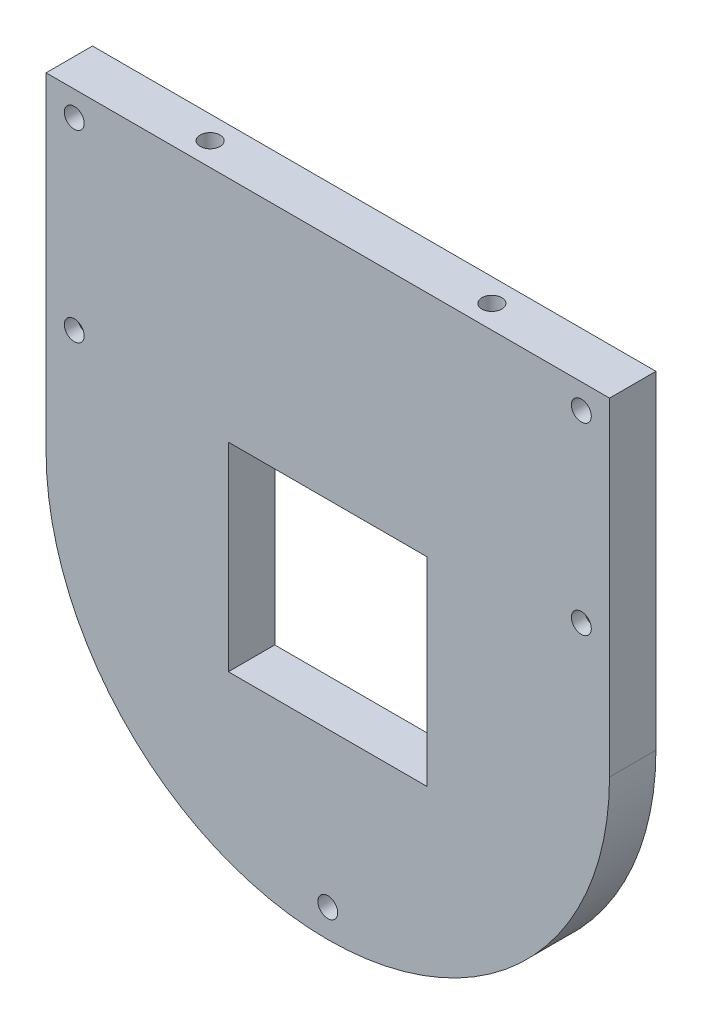
ISO-10303-21;
HEADER;
FILE_DESCRIPTION(('STEP AP214'),'2;1');
FILE_NAME('part.step','',(''),(''),'','','');
FILE_SCHEMA(('AUTOMOTIVE_DESIGN { 1 0 10303 214 1 1 1 1 }'));
ENDSEC;
DATA;
#1=APPLICATION_CONTEXT('core data for automotive mechanical design processes');
#2=APPLICATION_PROTOCOL_DEFINITION('international standard','automotive_design',2000,#1);
#3=PRODUCT_CONTEXT('',#1,'mechanical');
#4=PRODUCT('Part','Part','',(#3));
#5=PRODUCT_RELATED_PRODUCT_CATEGORY('part','',(#4));
#6=PRODUCT_DEFINITION_FORMATION('','',#4);
#7=PRODUCT_DEFINITION_CONTEXT('part definition',#1,'design');
#8=PRODUCT_DEFINITION('design','',#6,#7);
#9=PRODUCT_DEFINITION_SHAPE('','',#8);
#10=(LENGTH_UNIT() NAMED_UNIT(*) SI_UNIT(.MILLI.,.METRE.));
#11=(NAMED_UNIT(*) PLANE_ANGLE_UNIT() SI_UNIT($,.RADIAN.));
#12=(NAMED_UNIT(*) SI_UNIT($,.STERADIAN.) SOLID_ANGLE_UNIT());
#13=UNCERTAINTY_MEASURE_WITH_UNIT(LENGTH_MEASURE(1.E-05),#10,'distance_accuracy_value','');
#14=(GEOMETRIC_REPRESENTATION_CONTEXT(3) GLOBAL_UNCERTAINTY_ASSIGNED_CONTEXT((#13)) GLOBAL_UNIT_ASSIGNED_CONTEXT((#10,
#11,#12)) REPRESENTATION_CONTEXT('',''));
#15=CARTESIAN_POINT('',(0.,0.,0.));
#16=DIRECTION('',(0.,0.,1.));
#17=DIRECTION('',(1.,0.,0.));
#18=AXIS2_PLACEMENT_3D('',#15,#16,#17);
#19=CARTESIAN_POINT('',(80.75,63.,-3.));
#20=DIRECTION('',(0.,0.,1.));
#21=DIRECTION('',(1.,0.,0.));
#22=AXIS2_PLACEMENT_3D('',#19,#20,#21);
#23=CYLINDRICAL_SURFACE('',#22,1.5);
#24=CARTESIAN_POINT('',(80.75,63.,7.));
#25=DIRECTION('',(0.,0.,1.));
#26=DIRECTION('',(1.,0.,0.));
#27=AXIS2_PLACEMENT_3D('',#24,#25,#26);
#28=CIRCLE('',#27,1.5);
#29=CARTESIAN_POINT('',(82.25,63.,7.));
#30=VERTEX_POINT('',#29);
#31=EDGE_CURVE('E227',#30,#30,#28,.T.);
#32=ORIENTED_EDGE('',*,*,#31,.T.);
#33=EDGE_LOOP('',(#32));
#34=FACE_BOUND('',#33,.T.);
#35=CARTESIAN_POINT('',(80.75,63.,5.));
#36=DIRECTION('',(0.,0.,-1.));
#37=DIRECTION('',(-1.,0.,0.));
#38=AXIS2_PLACEMENT_3D('',#35,#36,#37);
#39=CIRCLE('',#38,1.5);
#40=CARTESIAN_POINT('',(79.25,63.,5.));
#41=VERTEX_POINT('',#40);
#42=EDGE_CURVE('E215',#41,#41,#39,.F.);
#43=ORIENTED_EDGE('',*,*,#42,.F.);
#44=EDGE_LOOP('',(#43));
#45=FACE_BOUND('',#44,.T.);
#46=ADVANCED_FACE('F42',(#34,#45),#23,.F.);
#47=CARTESIAN_POINT('',(85.,0.,7.));
#48=DIRECTION('',(-1.,0.,0.));
#49=DIRECTION('',(0.,0.,1.));
#50=AXIS2_PLACEMENT_3D('',#47,#48,#49);
#51=PLANE('',#50);
#52=DIRECTION('',(0.,1.,0.));
#53=VECTOR('',#52,1.);
#54=CARTESIAN_POINT('',(85.,0.,0.));
#55=LINE('',#54,#53);
#56=CARTESIAN_POINT('',(85.,45.,0.));
#57=VERTEX_POINT('',#56);
#58=CARTESIAN_POINT('',(85.,94.5,0.));
#59=VERTEX_POINT('',#58);
#60=EDGE_CURVE('E202',#57,#59,#55,.T.);
#61=ORIENTED_EDGE('',*,*,#60,.T.);
#62=DIRECTION('',(0.,0.,-1.));
#63=VECTOR('',#62,1.);
#64=CARTESIAN_POINT('',(85.,94.5,7.));
#65=LINE('',#64,#63);
#66=CARTESIAN_POINT('',(85.,94.5,7.));
#67=VERTEX_POINT('',#66);
#68=EDGE_CURVE('E60',#67,#59,#65,.T.);
#69=ORIENTED_EDGE('',*,*,#68,.F.);
#70=DIRECTION('',(0.,1.,0.));
#71=VECTOR('',#70,1.);
#72=CARTESIAN_POINT('',(85.,0.,7.));
#73=LINE('',#72,#71);
#74=CARTESIAN_POINT('',(85.,45.,7.));
#75=VERTEX_POINT('',#74);
#76=EDGE_CURVE('E11',#75,#67,#73,.T.);
#77=ORIENTED_EDGE('',*,*,#76,.F.);
#78=DIRECTION('',(0.,0.,-1.));
#79=VECTOR('',#78,1.);
#80=CARTESIAN_POINT('',(85.,45.,10.));
#81=LINE('',#80,#79);
#82=EDGE_CURVE('E239',#75,#57,#81,.T.);
#83=ORIENTED_EDGE('',*,*,#82,.T.);
#84=EDGE_LOOP('',(#61,#69,#77,#83));
#85=FACE_BOUND('',#84,.T.);
#86=ADVANCED_FACE('F343',(#85),#51,.F.);
#87=CARTESIAN_POINT('',(0.,0.,7.));
#88=DIRECTION('',(1.,0.,0.));
#89=DIRECTION('',(0.,0.,-1.));
#90=AXIS2_PLACEMENT_3D('',#87,#88,#89);
#91=PLANE('',#90);
#92=DIRECTION('',(0.,-1.,0.));
#93=VECTOR('',#92,1.);
#94=CARTESIAN_POINT('',(0.,0.,7.));
#95=LINE('',#94,#93);
#96=CARTESIAN_POINT('',(0.,94.5,7.));
#97=VERTEX_POINT('',#96);
#98=CARTESIAN_POINT('',(0.,45.,7.));
#99=VERTEX_POINT('',#98);
#100=EDGE_CURVE('E52',#97,#99,#95,.T.);
#101=ORIENTED_EDGE('',*,*,#100,.F.);
#102=DIRECTION('',(0.,0.,1.));
#103=VECTOR('',#102,1.);
#104=CARTESIAN_POINT('',(0.,94.5,7.));
#105=LINE('',#104,#103);
#106=CARTESIAN_POINT('',(0.,94.5,0.));
#107=VERTEX_POINT('',#106);
#108=EDGE_CURVE('E180',#107,#97,#105,.T.);
#109=ORIENTED_EDGE('',*,*,#108,.F.);
#110=DIRECTION('',(0.,-1.,0.));
#111=VECTOR('',#110,1.);
#112=CARTESIAN_POINT('',(0.,0.,0.));
#113=LINE('',#112,#111);
#114=CARTESIAN_POINT('',(0.,45.,0.));
#115=VERTEX_POINT('',#114);
#116=EDGE_CURVE('E206',#107,#115,#113,.T.);
#117=ORIENTED_EDGE('',*,*,#116,.T.);
#118=DIRECTION('',(0.,0.,-1.));
#119=VECTOR('',#118,1.);
#120=CARTESIAN_POINT('',(0.,45.,10.));
#121=LINE('',#120,#119);
#122=EDGE_CURVE('E200',#99,#115,#121,.T.);
#123=ORIENTED_EDGE('',*,*,#122,.F.);
#124=EDGE_LOOP('',(#101,#109,#117,#123));
#125=FACE_BOUND('',#124,.T.);
#126=ADVANCED_FACE('F44',(#125),#91,.F.);
#127=CARTESIAN_POINT('',(0.,0.,7.));
#128=DIRECTION('',(0.,0.,-1.));
#129=DIRECTION('',(-1.,0.,0.));
#130=AXIS2_PLACEMENT_3D('',#127,#128,#129);
#131=PLANE('',#130);
#132=CARTESIAN_POINT('',(42.5,6.75,7.));
#133=DIRECTION('',(0.,0.,1.));
#134=DIRECTION('',(1.,0.,0.));
#135=AXIS2_PLACEMENT_3D('',#132,#133,#134);
#136=CIRCLE('',#135,1.5);
#137=CARTESIAN_POINT('',(44.,6.75,7.));
#138=VERTEX_POINT('',#137);
#139=EDGE_CURVE('E717',#138,#138,#136,.T.);
#140=ORIENTED_EDGE('',*,*,#139,.F.);
#141=EDGE_LOOP('',(#140));
#142=FACE_BOUND('',#141,.T.);
#143=ORIENTED_EDGE('',*,*,#31,.F.);
#144=EDGE_LOOP('',(#143));
#145=FACE_BOUND('',#144,.T.);
#146=CARTESIAN_POINT('',(4.24999999999999,63.,7.));
#147=DIRECTION('',(0.,0.,1.));
#148=DIRECTION('',(-1.,0.,0.));
#149=AXIS2_PLACEMENT_3D('',#146,#147,#148);
#150=CIRCLE('',#149,1.5);
#151=CARTESIAN_POINT('',(2.74999999999999,63.,7.));
#152=VERTEX_POINT('',#151);
#153=EDGE_CURVE('E222',#152,#152,#150,.T.);
#154=ORIENTED_EDGE('',*,*,#153,.F.);
#155=EDGE_LOOP('',(#154));
#156=FACE_BOUND('',#155,.T.);
#157=CARTESIAN_POINT('',(4.24999999999999,90.75,7.));
#158=DIRECTION('',(0.,0.,-1.));
#159=DIRECTION('',(-1.,0.,0.));
#160=AXIS2_PLACEMENT_3D('',#157,#158,#159);
#161=CIRCLE('',#160,1.5);
#162=CARTESIAN_POINT('',(2.74999999999999,90.75,7.));
#163=VERTEX_POINT('',#162);
#164=EDGE_CURVE('E260',#163,#163,#161,.T.);
#165=ORIENTED_EDGE('',*,*,#164,.T.);
#166=EDGE_LOOP('',(#165));
#167=FACE_BOUND('',#166,.T.);
#168=CARTESIAN_POINT('',(80.75,90.75,7.));
#169=DIRECTION('',(0.,0.,-1.));
#170=DIRECTION('',(-1.,0.,0.));
#171=AXIS2_PLACEMENT_3D('',#168,#169,#170);
#172=CIRCLE('',#171,1.5);
#173=CARTESIAN_POINT('',(79.25,90.75,7.));
#174=VERTEX_POINT('',#173);
#175=EDGE_CURVE('E256',#174,#174,#172,.T.);
#176=ORIENTED_EDGE('',*,*,#175,.T.);
#177=EDGE_LOOP('',(#176));
#178=FACE_BOUND('',#177,.T.);
#179=DIRECTION('',(-1.,0.,0.));
#180=VECTOR('',#179,1.);
#181=CARTESIAN_POINT('',(27.5,60.,7.));
#182=LINE('',#181,#180);
#183=CARTESIAN_POINT('',(57.5,60.,7.));
#184=VERTEX_POINT('',#183);
#185=CARTESIAN_POINT('',(27.5,60.,7.));
#186=VERTEX_POINT('',#185);
#187=EDGE_CURVE('E292',#184,#186,#182,.T.);
#188=ORIENTED_EDGE('',*,*,#187,.F.);
#189=DIRECTION('',(0.,1.,0.));
#190=VECTOR('',#189,1.);
#191=CARTESIAN_POINT('',(57.5,30.,7.));
#192=LINE('',#191,#190);
#193=CARTESIAN_POINT('',(57.5,30.,7.));
#194=VERTEX_POINT('',#193);
#195=EDGE_CURVE('E269',#194,#184,#192,.T.);
#196=ORIENTED_EDGE('',*,*,#195,.F.);
#197=DIRECTION('',(1.,0.,0.));
#198=VECTOR('',#197,1.);
#199=CARTESIAN_POINT('',(27.5,30.,7.));
#200=LINE('',#199,#198);
#201=CARTESIAN_POINT('',(27.5,30.,7.));
#202=VERTEX_POINT('',#201);
#203=EDGE_CURVE('E278',#202,#194,#200,.T.);
#204=ORIENTED_EDGE('',*,*,#203,.F.);
#205=DIRECTION('',(0.,-1.,0.));
#206=VECTOR('',#205,1.);
#207=CARTESIAN_POINT('',(27.5,30.,7.));
#208=LINE('',#207,#206);
#209=EDGE_CURVE('E296',#186,#202,#208,.T.);
#210=ORIENTED_EDGE('',*,*,#209,.F.);
#211=EDGE_LOOP('',(#188,#196,#204,#210));
#212=FACE_BOUND('',#211,.T.);
#213=ORIENTED_EDGE('',*,*,#76,.T.);
#214=DIRECTION('',(1.,0.,0.));
#215=VECTOR('',#214,1.);
#216=CARTESIAN_POINT('',(0.,94.5,7.));
#217=LINE('',#216,#215);
#218=EDGE_CURVE('E184',#97,#67,#217,.T.);
#219=ORIENTED_EDGE('',*,*,#218,.F.);
#220=ORIENTED_EDGE('',*,*,#100,.T.);
#221=CARTESIAN_POINT('',(42.5,45.,7.));
#222=DIRECTION('',(0.,0.,-1.));
#223=DIRECTION('',(-1.,0.,0.));
#224=AXIS2_PLACEMENT_3D('',#221,#222,#223);
#225=CIRCLE('',#224,42.5);
#226=EDGE_CURVE('E242',#99,#75,#225,.F.);
#227=ORIENTED_EDGE('',*,*,#226,.T.);
#228=EDGE_LOOP('',(#213,#219,#220,#227));
#229=FACE_BOUND('',#228,.T.);
#230=ADVANCED_FACE('F192',(#142,#145,#156,#167,#178,#212,#229),#131,.F.);
#231=CARTESIAN_POINT('',(0.,0.,0.));
#232=DIRECTION('',(0.,0.,-1.));
#233=DIRECTION('',(-1.,0.,0.));
#234=AXIS2_PLACEMENT_3D('',#231,#232,#233);
#235=PLANE('',#234);
#236=DIRECTION('',(-1.,0.,0.));
#237=VECTOR('',#236,1.);
#238=CARTESIAN_POINT('',(0.,94.5,0.));
#239=LINE('',#238,#237);
#240=EDGE_CURVE('E185',#59,#107,#239,.T.);
#241=ORIENTED_EDGE('',*,*,#240,.F.);
#242=ORIENTED_EDGE('',*,*,#60,.F.);
#243=CARTESIAN_POINT('',(42.5,45.,0.));
#244=DIRECTION('',(0.,0.,1.));
#245=DIRECTION('',(-1.,0.,0.));
#246=AXIS2_PLACEMENT_3D('',#243,#244,#245);
#247=CIRCLE('',#246,42.5);
#248=EDGE_CURVE('E233',#115,#57,#247,.T.);
#249=ORIENTED_EDGE('',*,*,#248,.F.);
#250=ORIENTED_EDGE('',*,*,#116,.F.);
#251=EDGE_LOOP('',(#241,#242,#249,#250));
#252=FACE_BOUND('',#251,.T.);
#253=DIRECTION('',(0.5,0.866025403784438,0.));
#254=VECTOR('',#253,1.);
#255=CARTESIAN_POINT('',(77.34,63.,0.));
#256=LINE('',#255,#254);
#257=CARTESIAN_POINT('',(77.34,63.,0.));
#258=VERTEX_POINT('',#257);
#259=CARTESIAN_POINT('',(79.045,65.9531466269049,0.));
#260=VERTEX_POINT('',#259);
#261=EDGE_CURVE('E68',#258,#260,#256,.T.);
#262=ORIENTED_EDGE('',*,*,#261,.F.);
#263=DIRECTION('',(-0.499999999999997,0.86602540378444,0.));
#264=VECTOR('',#263,1.);
#265=CARTESIAN_POINT('',(79.045,60.0468533730951,0.));
#266=LINE('',#265,#264);
#267=CARTESIAN_POINT('',(79.045,60.0468533730951,0.));
#268=VERTEX_POINT('',#267);
#269=EDGE_CURVE('E744',#268,#258,#266,.T.);
#270=ORIENTED_EDGE('',*,*,#269,.F.);
#271=DIRECTION('',(-1.,0.,0.));
#272=VECTOR('',#271,1.);
#273=CARTESIAN_POINT('',(82.455,60.0468533730951,0.));
#274=LINE('',#273,#272);
#275=CARTESIAN_POINT('',(82.455,60.0468533730951,0.));
#276=VERTEX_POINT('',#275);
#277=EDGE_CURVE('E780',#276,#268,#274,.T.);
#278=ORIENTED_EDGE('',*,*,#277,.F.);
#279=DIRECTION('',(-0.500000000000003,-0.866025403784437,0.));
#280=VECTOR('',#279,1.);
#281=CARTESIAN_POINT('',(84.16,63.,0.));
#282=LINE('',#281,#280);
#283=CARTESIAN_POINT('',(84.16,63.,0.));
#284=VERTEX_POINT('',#283);
#285=EDGE_CURVE('E776',#284,#276,#282,.T.);
#286=ORIENTED_EDGE('',*,*,#285,.F.);
#287=DIRECTION('',(0.500000000000004,-0.866025403784436,0.));
#288=VECTOR('',#287,1.);
#289=CARTESIAN_POINT('',(82.455,65.9531466269049,0.));
#290=LINE('',#289,#288);
#291=CARTESIAN_POINT('',(82.455,65.9531466269049,0.));
#292=VERTEX_POINT('',#291);
#293=EDGE_CURVE('E772',#292,#284,#290,.T.);
#294=ORIENTED_EDGE('',*,*,#293,.F.);
#295=DIRECTION('',(1.,0.,0.));
#296=VECTOR('',#295,1.);
#297=CARTESIAN_POINT('',(79.045,65.9531466269049,0.));
#298=LINE('',#297,#296);
#299=EDGE_CURVE('E767',#260,#292,#298,.T.);
#300=ORIENTED_EDGE('',*,*,#299,.F.);
#301=EDGE_LOOP('',(#262,#270,#278,#286,#294,#300));
#302=FACE_BOUND('',#301,.T.);
#303=DIRECTION('',(0.500000000000004,0.866025403784436,0.));
#304=VECTOR('',#303,1.);
#305=CARTESIAN_POINT('',(2.54500000000001,65.9531466269049,0.));
#306=LINE('',#305,#304);
#307=CARTESIAN_POINT('',(0.840000000000021,63.,0.));
#308=VERTEX_POINT('',#307);
#309=CARTESIAN_POINT('',(2.54500000000001,65.9531466269049,0.));
#310=VERTEX_POINT('',#309);
#311=EDGE_CURVE('E768',#308,#310,#306,.T.);
#312=ORIENTED_EDGE('',*,*,#311,.F.);
#313=DIRECTION('',(-0.500000000000003,0.866025403784437,0.));
#314=VECTOR('',#313,1.);
#315=CARTESIAN_POINT('',(0.840000000000021,63.,0.));
#316=LINE('',#315,#314);
#317=CARTESIAN_POINT('',(2.54500000000003,60.0468533730951,0.));
#318=VERTEX_POINT('',#317);
#319=EDGE_CURVE('E822',#318,#308,#316,.T.);
#320=ORIENTED_EDGE('',*,*,#319,.F.);
#321=DIRECTION('',(-1.,0.,0.));
#322=VECTOR('',#321,1.);
#323=CARTESIAN_POINT('',(2.54500000000003,60.0468533730951,0.));
#324=LINE('',#323,#322);
#325=CARTESIAN_POINT('',(5.95499999999999,60.0468533730951,0.));
#326=VERTEX_POINT('',#325);
#327=EDGE_CURVE('E826',#326,#318,#324,.T.);
#328=ORIENTED_EDGE('',*,*,#327,.F.);
#329=DIRECTION('',(-0.499999999999997,-0.86602540378444,0.));
#330=VECTOR('',#329,1.);
#331=CARTESIAN_POINT('',(5.95499999999999,60.0468533730951,0.));
#332=LINE('',#331,#330);
#333=CARTESIAN_POINT('',(7.65999999999996,63.,0.));
#334=VERTEX_POINT('',#333);
#335=EDGE_CURVE('E831',#334,#326,#332,.T.);
#336=ORIENTED_EDGE('',*,*,#335,.F.);
#337=DIRECTION('',(0.5,-0.866025403784438,0.));
#338=VECTOR('',#337,1.);
#339=CARTESIAN_POINT('',(7.65999999999996,63.,0.));
#340=LINE('',#339,#338);
#341=CARTESIAN_POINT('',(5.95499999999997,65.9531466269049,0.));
#342=VERTEX_POINT('',#341);
#343=EDGE_CURVE('E835',#342,#334,#340,.T.);
#344=ORIENTED_EDGE('',*,*,#343,.F.);
#345=DIRECTION('',(1.,0.,0.));
#346=VECTOR('',#345,1.);
#347=CARTESIAN_POINT('',(5.95499999999997,65.9531466269049,0.));
#348=LINE('',#347,#346);
#349=EDGE_CURVE('E839',#310,#342,#348,.T.);
#350=ORIENTED_EDGE('',*,*,#349,.F.);
#351=EDGE_LOOP('',(#312,#320,#328,#336,#344,#350));
#352=FACE_BOUND('',#351,.T.);
#353=CARTESIAN_POINT('',(4.24999999999999,90.75,0.));
#354=DIRECTION('',(0.,0.,-1.));
#355=DIRECTION('',(1.,0.,0.));
#356=AXIS2_PLACEMENT_3D('',#353,#354,#355);
#357=CIRCLE('',#356,1.5);
#358=CARTESIAN_POINT('',(5.74999999999999,90.75,0.));
#359=VERTEX_POINT('',#358);
#360=EDGE_CURVE('E248',#359,#359,#357,.T.);
#361=ORIENTED_EDGE('',*,*,#360,.F.);
#362=EDGE_LOOP('',(#361));
#363=FACE_BOUND('',#362,.T.);
#364=CARTESIAN_POINT('',(80.75,90.75,0.));
#365=DIRECTION('',(0.,0.,-1.));
#366=DIRECTION('',(-1.,0.,0.));
#367=AXIS2_PLACEMENT_3D('',#364,#365,#366);
#368=CIRCLE('',#367,1.5);
#369=CARTESIAN_POINT('',(79.25,90.75,0.));
#370=VERTEX_POINT('',#369);
#371=EDGE_CURVE('E252',#370,#370,#368,.T.);
#372=ORIENTED_EDGE('',*,*,#371,.F.);
#373=EDGE_LOOP('',(#372));
#374=FACE_BOUND('',#373,.T.);
#375=DIRECTION('',(0.,1.,0.));
#376=VECTOR('',#375,1.);
#377=CARTESIAN_POINT('',(57.5,30.,0.));
#378=LINE('',#377,#376);
#379=CARTESIAN_POINT('',(57.5,30.,0.));
#380=VERTEX_POINT('',#379);
#381=CARTESIAN_POINT('',(57.5,60.,0.));
#382=VERTEX_POINT('',#381);
#383=EDGE_CURVE('E273',#380,#382,#378,.T.);
#384=ORIENTED_EDGE('',*,*,#383,.T.);
#385=DIRECTION('',(-1.,0.,0.));
#386=VECTOR('',#385,1.);
#387=CARTESIAN_POINT('',(27.5,60.,0.));
#388=LINE('',#387,#386);
#389=CARTESIAN_POINT('',(27.5,60.,0.));
#390=VERTEX_POINT('',#389);
#391=EDGE_CURVE('E277',#382,#390,#388,.T.);
#392=ORIENTED_EDGE('',*,*,#391,.T.);
#393=DIRECTION('',(0.,-1.,0.));
#394=VECTOR('',#393,1.);
#395=CARTESIAN_POINT('',(27.5,30.,0.));
#396=LINE('',#395,#394);
#397=CARTESIAN_POINT('',(27.5,30.,0.));
#398=VERTEX_POINT('',#397);
#399=EDGE_CURVE('E282',#390,#398,#396,.T.);
#400=ORIENTED_EDGE('',*,*,#399,.T.);
#401=DIRECTION('',(1.,0.,0.));
#402=VECTOR('',#401,1.);
#403=CARTESIAN_POINT('',(27.5,30.,0.));
#404=LINE('',#403,#402);
#405=EDGE_CURVE('E286',#398,#380,#404,.T.);
#406=ORIENTED_EDGE('',*,*,#405,.T.);
#407=EDGE_LOOP('',(#384,#392,#400,#406));
#408=FACE_BOUND('',#407,.T.);
#409=ADVANCED_FACE('F328',(#252,#302,#352,#363,#374,#408),#235,.T.);
#410=CARTESIAN_POINT('',(57.5,30.,0.));
#411=DIRECTION('',(1.,0.,0.));
#412=DIRECTION('',(0.,0.,-1.));
#413=AXIS2_PLACEMENT_3D('',#410,#411,#412);
#414=PLANE('',#413);
#415=ORIENTED_EDGE('',*,*,#195,.T.);
#416=DIRECTION('',(0.,0.,1.));
#417=VECTOR('',#416,1.);
#418=CARTESIAN_POINT('',(57.5,60.,0.));
#419=LINE('',#418,#417);
#420=EDGE_CURVE('E209',#382,#184,#419,.T.);
#421=ORIENTED_EDGE('',*,*,#420,.F.);
#422=ORIENTED_EDGE('',*,*,#383,.F.);
#423=DIRECTION('',(0.,0.,1.));
#424=VECTOR('',#423,1.);
#425=CARTESIAN_POINT('',(57.5,30.,0.));
#426=LINE('',#425,#424);
#427=EDGE_CURVE('E213',#380,#194,#426,.T.);
#428=ORIENTED_EDGE('',*,*,#427,.T.);
#429=EDGE_LOOP('',(#415,#421,#422,#428));
#430=FACE_BOUND('',#429,.T.);
#431=ADVANCED_FACE('F329',(#430),#414,.F.);
#432=CARTESIAN_POINT('',(27.5,30.,0.));
#433=DIRECTION('',(0.,-1.,0.));
#434=DIRECTION('',(0.,0.,-1.));
#435=AXIS2_PLACEMENT_3D('',#432,#433,#434);
#436=PLANE('',#435);
#437=ORIENTED_EDGE('',*,*,#203,.T.);
#438=ORIENTED_EDGE('',*,*,#427,.F.);
#439=ORIENTED_EDGE('',*,*,#405,.F.);
#440=DIRECTION('',(0.,0.,1.));
#441=VECTOR('',#440,1.);
#442=CARTESIAN_POINT('',(27.5,30.,0.));
#443=LINE('',#442,#441);
#444=EDGE_CURVE('E305',#398,#202,#443,.T.);
#445=ORIENTED_EDGE('',*,*,#444,.T.);
#446=EDGE_LOOP('',(#437,#438,#439,#445));
#447=FACE_BOUND('',#446,.T.);
#448=ADVANCED_FACE('F326',(#447),#436,.F.);
#449=CARTESIAN_POINT('',(27.5,30.,0.));
#450=DIRECTION('',(-1.,0.,0.));
#451=DIRECTION('',(0.,0.,1.));
#452=AXIS2_PLACEMENT_3D('',#449,#450,#451);
#453=PLANE('',#452);
#454=ORIENTED_EDGE('',*,*,#209,.T.);
#455=ORIENTED_EDGE('',*,*,#444,.F.);
#456=ORIENTED_EDGE('',*,*,#399,.F.);
#457=DIRECTION('',(0.,0.,1.));
#458=VECTOR('',#457,1.);
#459=CARTESIAN_POINT('',(27.5,60.,0.));
#460=LINE('',#459,#458);
#461=EDGE_CURVE('E307',#390,#186,#460,.T.);
#462=ORIENTED_EDGE('',*,*,#461,.T.);
#463=EDGE_LOOP('',(#454,#455,#456,#462));
#464=FACE_BOUND('',#463,.T.);
#465=ADVANCED_FACE('F323',(#464),#453,.F.);
#466=CARTESIAN_POINT('',(27.5,60.,0.));
#467=DIRECTION('',(0.,1.,0.));
#468=DIRECTION('',(0.,0.,1.));
#469=AXIS2_PLACEMENT_3D('',#466,#467,#468);
#470=PLANE('',#469);
#471=ORIENTED_EDGE('',*,*,#187,.T.);
#472=ORIENTED_EDGE('',*,*,#461,.F.);
#473=ORIENTED_EDGE('',*,*,#391,.F.);
#474=ORIENTED_EDGE('',*,*,#420,.T.);
#475=EDGE_LOOP('',(#471,#472,#473,#474));
#476=FACE_BOUND('',#475,.T.);
#477=ADVANCED_FACE('F316',(#476),#470,.F.);
#478=CARTESIAN_POINT('',(80.75,90.75,8.));
#479=DIRECTION('',(0.,0.,-1.));
#480=DIRECTION('',(-1.,0.,0.));
#481=AXIS2_PLACEMENT_3D('',#478,#479,#480);
#482=CYLINDRICAL_SURFACE('',#481,1.5);
#483=ORIENTED_EDGE('',*,*,#371,.T.);
#484=EDGE_LOOP('',(#483));
#485=FACE_BOUND('',#484,.T.);
#486=ORIENTED_EDGE('',*,*,#175,.F.);
#487=EDGE_LOOP('',(#486));
#488=FACE_BOUND('',#487,.T.);
#489=ADVANCED_FACE('F368',(#485,#488),#482,.F.);
#490=CARTESIAN_POINT('',(4.24999999999999,90.75,8.));
#491=DIRECTION('',(0.,0.,-1.));
#492=DIRECTION('',(-1.,0.,0.));
#493=AXIS2_PLACEMENT_3D('',#490,#491,#492);
#494=CYLINDRICAL_SURFACE('',#493,1.5);
#495=ORIENTED_EDGE('',*,*,#360,.T.);
#496=EDGE_LOOP('',(#495));
#497=FACE_BOUND('',#496,.T.);
#498=ORIENTED_EDGE('',*,*,#164,.F.);
#499=EDGE_LOOP('',(#498));
#500=FACE_BOUND('',#499,.T.);
#501=ADVANCED_FACE('F364',(#497,#500),#494,.F.);
#502=CARTESIAN_POINT('',(42.5,45.,10.));
#503=DIRECTION('',(0.,0.,-1.));
#504=DIRECTION('',(-1.,0.,0.));
#505=AXIS2_PLACEMENT_3D('',#502,#503,#504);
#506=CYLINDRICAL_SURFACE('',#505,42.5);
#507=ORIENTED_EDGE('',*,*,#122,.T.);
#508=ORIENTED_EDGE('',*,*,#248,.T.);
#509=ORIENTED_EDGE('',*,*,#82,.F.);
#510=ORIENTED_EDGE('',*,*,#226,.F.);
#511=EDGE_LOOP('',(#507,#508,#509,#510));
#512=FACE_BOUND('',#511,.T.);
#513=ADVANCED_FACE('F361',(#512),#506,.T.);
#514=CARTESIAN_POINT('',(4.24999999999999,63.,-3.));
#515=DIRECTION('',(0.,0.,1.));
#516=DIRECTION('',(1.,0.,0.));
#517=AXIS2_PLACEMENT_3D('',#514,#515,#516);
#518=CYLINDRICAL_SURFACE('',#517,1.5);
#519=CARTESIAN_POINT('',(4.24999999999999,63.,5.));
#520=DIRECTION('',(0.,0.,1.));
#521=DIRECTION('',(1.,0.,0.));
#522=AXIS2_PLACEMENT_3D('',#519,#520,#521);
#523=CIRCLE('',#522,1.5);
#524=CARTESIAN_POINT('',(5.74999999999999,63.,5.));
#525=VERTEX_POINT('',#524);
#526=EDGE_CURVE('E218',#525,#525,#523,.F.);
#527=ORIENTED_EDGE('',*,*,#526,.T.);
#528=EDGE_LOOP('',(#527));
#529=FACE_BOUND('',#528,.T.);
#530=ORIENTED_EDGE('',*,*,#153,.T.);
#531=EDGE_LOOP('',(#530));
#532=FACE_BOUND('',#531,.T.);
#533=ADVANCED_FACE('F357',(#529,#532),#518,.F.);
#534=CARTESIAN_POINT('',(0.,0.,5.));
#535=DIRECTION('',(0.,0.,-1.));
#536=DIRECTION('',(-1.,0.,0.));
#537=AXIS2_PLACEMENT_3D('',#534,#535,#536);
#538=PLANE('',#537);
#539=DIRECTION('',(0.5,0.866025403784438,0.));
#540=VECTOR('',#539,1.);
#541=CARTESIAN_POINT('',(77.34,63.,5.));
#542=LINE('',#541,#540);
#543=CARTESIAN_POINT('',(77.34,63.,5.));
#544=VERTEX_POINT('',#543);
#545=CARTESIAN_POINT('',(79.045,65.9531466269049,5.));
#546=VERTEX_POINT('',#545);
#547=EDGE_CURVE('E739',#544,#546,#542,.T.);
#548=ORIENTED_EDGE('',*,*,#547,.T.);
#549=DIRECTION('',(1.,0.,0.));
#550=VECTOR('',#549,1.);
#551=CARTESIAN_POINT('',(79.045,65.9531466269049,5.));
#552=LINE('',#551,#550);
#553=CARTESIAN_POINT('',(82.455,65.9531466269049,5.));
#554=VERTEX_POINT('',#553);
#555=EDGE_CURVE('E743',#546,#554,#552,.T.);
#556=ORIENTED_EDGE('',*,*,#555,.T.);
#557=DIRECTION('',(0.500000000000004,-0.866025403784436,0.));
#558=VECTOR('',#557,1.);
#559=CARTESIAN_POINT('',(82.455,65.9531466269049,5.));
#560=LINE('',#559,#558);
#561=CARTESIAN_POINT('',(84.16,63.,5.));
#562=VERTEX_POINT('',#561);
#563=EDGE_CURVE('E748',#554,#562,#560,.T.);
#564=ORIENTED_EDGE('',*,*,#563,.T.);
#565=DIRECTION('',(-0.500000000000003,-0.866025403784437,0.));
#566=VECTOR('',#565,1.);
#567=CARTESIAN_POINT('',(84.16,63.,5.));
#568=LINE('',#567,#566);
#569=CARTESIAN_POINT('',(82.455,60.0468533730951,5.));
#570=VERTEX_POINT('',#569);
#571=EDGE_CURVE('E752',#562,#570,#568,.T.);
#572=ORIENTED_EDGE('',*,*,#571,.T.);
#573=DIRECTION('',(-1.,0.,0.));
#574=VECTOR('',#573,1.);
#575=CARTESIAN_POINT('',(82.455,60.0468533730951,5.));
#576=LINE('',#575,#574);
#577=CARTESIAN_POINT('',(79.045,60.0468533730951,5.));
#578=VERTEX_POINT('',#577);
#579=EDGE_CURVE('E756',#570,#578,#576,.T.);
#580=ORIENTED_EDGE('',*,*,#579,.T.);
#581=DIRECTION('',(-0.499999999999997,0.86602540378444,0.));
#582=VECTOR('',#581,1.);
#583=CARTESIAN_POINT('',(79.045,60.0468533730951,5.));
#584=LINE('',#583,#582);
#585=EDGE_CURVE('E760',#578,#544,#584,.T.);
#586=ORIENTED_EDGE('',*,*,#585,.T.);
#587=EDGE_LOOP('',(#548,#556,#564,#572,#580,#586));
#588=FACE_BOUND('',#587,.T.);
#589=ORIENTED_EDGE('',*,*,#42,.T.);
#590=EDGE_LOOP('',(#589));
#591=FACE_BOUND('',#590,.T.);
#592=ADVANCED_FACE('F360',(#588,#591),#538,.T.);
#593=CARTESIAN_POINT('',(77.34,63.,5.));
#594=DIRECTION('',(-0.866025403784438,0.5,0.));
#595=DIRECTION('',(-0.5,-0.866025403784439,0.));
#596=AXIS2_PLACEMENT_3D('',#593,#594,#595);
#597=PLANE('',#596);
#598=ORIENTED_EDGE('',*,*,#261,.T.);
#599=DIRECTION('',(0.,0.,-1.));
#600=VECTOR('',#599,1.);
#601=CARTESIAN_POINT('',(79.045,65.9531466269049,5.));
#602=LINE('',#601,#600);
#603=EDGE_CURVE('E764',#546,#260,#602,.T.);
#604=ORIENTED_EDGE('',*,*,#603,.F.);
#605=ORIENTED_EDGE('',*,*,#547,.F.);
#606=DIRECTION('',(0.,0.,-1.));
#607=VECTOR('',#606,1.);
#608=CARTESIAN_POINT('',(77.34,63.,5.));
#609=LINE('',#608,#607);
#610=EDGE_CURVE('E219',#544,#258,#609,.T.);
#611=ORIENTED_EDGE('',*,*,#610,.T.);
#612=EDGE_LOOP('',(#598,#604,#605,#611));
#613=FACE_BOUND('',#612,.T.);
#614=ADVANCED_FACE('F436',(#613),#597,.F.);
#615=CARTESIAN_POINT('',(79.045,60.0468533730951,5.));
#616=DIRECTION('',(-0.86602540378444,-0.499999999999997,0.));
#617=DIRECTION('',(0.499999999999997,-0.86602540378444,0.));
#618=AXIS2_PLACEMENT_3D('',#615,#616,#617);
#619=PLANE('',#618);
#620=ORIENTED_EDGE('',*,*,#269,.T.);
#621=ORIENTED_EDGE('',*,*,#610,.F.);
#622=ORIENTED_EDGE('',*,*,#585,.F.);
#623=DIRECTION('',(0.,0.,-1.));
#624=VECTOR('',#623,1.);
#625=CARTESIAN_POINT('',(79.045,60.0468533730951,5.));
#626=LINE('',#625,#624);
#627=EDGE_CURVE('E789',#578,#268,#626,.T.);
#628=ORIENTED_EDGE('',*,*,#627,.T.);
#629=EDGE_LOOP('',(#620,#621,#622,#628));
#630=FACE_BOUND('',#629,.T.);
#631=ADVANCED_FACE('F447',(#630),#619,.F.);
#632=CARTESIAN_POINT('',(82.455,60.0468533730951,5.));
#633=DIRECTION('',(0.,-1.,0.));
#634=DIRECTION('',(0.,0.,-1.));
#635=AXIS2_PLACEMENT_3D('',#632,#633,#634);
#636=PLANE('',#635);
#637=ORIENTED_EDGE('',*,*,#277,.T.);
#638=ORIENTED_EDGE('',*,*,#627,.F.);
#639=ORIENTED_EDGE('',*,*,#579,.F.);
#640=DIRECTION('',(0.,0.,-1.));
#641=VECTOR('',#640,1.);
#642=CARTESIAN_POINT('',(82.455,60.0468533730951,5.));
#643=LINE('',#642,#641);
#644=EDGE_CURVE('E792',#570,#276,#643,.T.);
#645=ORIENTED_EDGE('',*,*,#644,.T.);
#646=EDGE_LOOP('',(#637,#638,#639,#645));
#647=FACE_BOUND('',#646,.T.);
#648=ADVANCED_FACE('F457',(#647),#636,.F.);
#649=CARTESIAN_POINT('',(84.16,63.,5.));
#650=DIRECTION('',(0.866025403784437,-0.500000000000003,0.));
#651=DIRECTION('',(0.500000000000003,0.866025403784437,0.));
#652=AXIS2_PLACEMENT_3D('',#649,#650,#651);
#653=PLANE('',#652);
#654=ORIENTED_EDGE('',*,*,#285,.T.);
#655=ORIENTED_EDGE('',*,*,#644,.F.);
#656=ORIENTED_EDGE('',*,*,#571,.F.);
#657=DIRECTION('',(0.,0.,-1.));
#658=VECTOR('',#657,1.);
#659=CARTESIAN_POINT('',(84.16,63.,5.));
#660=LINE('',#659,#658);
#661=EDGE_CURVE('E795',#562,#284,#660,.T.);
#662=ORIENTED_EDGE('',*,*,#661,.T.);
#663=EDGE_LOOP('',(#654,#655,#656,#662));
#664=FACE_BOUND('',#663,.T.);
#665=ADVANCED_FACE('F468',(#664),#653,.F.);
#666=CARTESIAN_POINT('',(82.455,65.9531466269049,5.));
#667=DIRECTION('',(0.866025403784436,0.500000000000004,0.));
#668=DIRECTION('',(-0.500000000000004,0.866025403784437,0.));
#669=AXIS2_PLACEMENT_3D('',#666,#667,#668);
#670=PLANE('',#669);
#671=ORIENTED_EDGE('',*,*,#293,.T.);
#672=ORIENTED_EDGE('',*,*,#661,.F.);
#673=ORIENTED_EDGE('',*,*,#563,.F.);
#674=DIRECTION('',(0.,0.,-1.));
#675=VECTOR('',#674,1.);
#676=CARTESIAN_POINT('',(82.455,65.9531466269049,5.));
#677=LINE('',#676,#675);
#678=EDGE_CURVE('E798',#554,#292,#677,.T.);
#679=ORIENTED_EDGE('',*,*,#678,.T.);
#680=EDGE_LOOP('',(#671,#672,#673,#679));
#681=FACE_BOUND('',#680,.T.);
#682=ADVANCED_FACE('F479',(#681),#670,.F.);
#683=CARTESIAN_POINT('',(79.045,65.9531466269049,5.));
#684=DIRECTION('',(0.,1.,0.));
#685=DIRECTION('',(0.,0.,1.));
#686=AXIS2_PLACEMENT_3D('',#683,#684,#685);
#687=PLANE('',#686);
#688=ORIENTED_EDGE('',*,*,#299,.T.);
#689=ORIENTED_EDGE('',*,*,#678,.F.);
#690=ORIENTED_EDGE('',*,*,#555,.F.);
#691=ORIENTED_EDGE('',*,*,#603,.T.);
#692=EDGE_LOOP('',(#688,#689,#690,#691));
#693=FACE_BOUND('',#692,.T.);
#694=ADVANCED_FACE('F490',(#693),#687,.F.);
#695=CARTESIAN_POINT('',(0.,0.,5.));
#696=DIRECTION('',(0.,0.,1.));
#697=DIRECTION('',(1.,0.,0.));
#698=AXIS2_PLACEMENT_3D('',#695,#696,#697);
#699=PLANE('',#698);
#700=DIRECTION('',(0.500000000000004,0.866025403784436,0.));
#701=VECTOR('',#700,1.);
#702=CARTESIAN_POINT('',(2.54500000000001,65.9531466269049,5.));
#703=LINE('',#702,#701);
#704=CARTESIAN_POINT('',(0.840000000000021,63.,5.));
#705=VERTEX_POINT('',#704);
#706=CARTESIAN_POINT('',(2.54500000000001,65.9531466269049,5.));
#707=VERTEX_POINT('',#706);
#708=EDGE_CURVE('E827',#705,#707,#703,.T.);
#709=ORIENTED_EDGE('',*,*,#708,.T.);
#710=DIRECTION('',(1.,0.,0.));
#711=VECTOR('',#710,1.);
#712=CARTESIAN_POINT('',(5.95499999999997,65.9531466269049,5.));
#713=LINE('',#712,#711);
#714=CARTESIAN_POINT('',(5.95499999999997,65.9531466269049,5.));
#715=VERTEX_POINT('',#714);
#716=EDGE_CURVE('E860',#707,#715,#713,.T.);
#717=ORIENTED_EDGE('',*,*,#716,.T.);
#718=DIRECTION('',(0.5,-0.866025403784438,0.));
#719=VECTOR('',#718,1.);
#720=CARTESIAN_POINT('',(7.65999999999996,63.,5.));
#721=LINE('',#720,#719);
#722=CARTESIAN_POINT('',(7.65999999999996,63.,5.));
#723=VERTEX_POINT('',#722);
#724=EDGE_CURVE('E856',#715,#723,#721,.T.);
#725=ORIENTED_EDGE('',*,*,#724,.T.);
#726=DIRECTION('',(-0.499999999999997,-0.86602540378444,0.));
#727=VECTOR('',#726,1.);
#728=CARTESIAN_POINT('',(5.95499999999999,60.0468533730951,5.));
#729=LINE('',#728,#727);
#730=CARTESIAN_POINT('',(5.95499999999999,60.0468533730951,5.));
#731=VERTEX_POINT('',#730);
#732=EDGE_CURVE('E852',#723,#731,#729,.T.);
#733=ORIENTED_EDGE('',*,*,#732,.T.);
#734=DIRECTION('',(-1.,0.,0.));
#735=VECTOR('',#734,1.);
#736=CARTESIAN_POINT('',(2.54500000000003,60.0468533730951,5.));
#737=LINE('',#736,#735);
#738=CARTESIAN_POINT('',(2.54500000000003,60.0468533730951,5.));
#739=VERTEX_POINT('',#738);
#740=EDGE_CURVE('E848',#731,#739,#737,.T.);
#741=ORIENTED_EDGE('',*,*,#740,.T.);
#742=DIRECTION('',(-0.500000000000003,0.866025403784437,0.));
#743=VECTOR('',#742,1.);
#744=CARTESIAN_POINT('',(0.840000000000021,63.,5.));
#745=LINE('',#744,#743);
#746=EDGE_CURVE('E807',#739,#705,#745,.T.);
#747=ORIENTED_EDGE('',*,*,#746,.T.);
#748=EDGE_LOOP('',(#709,#717,#725,#733,#741,#747));
#749=FACE_BOUND('',#748,.T.);
#750=ORIENTED_EDGE('',*,*,#526,.F.);
#751=EDGE_LOOP('',(#750));
#752=FACE_BOUND('',#751,.T.);
#753=ADVANCED_FACE('F355',(#749,#752),#699,.F.);
#754=CARTESIAN_POINT('',(2.54500000000001,65.9531466269049,5.));
#755=DIRECTION('',(-0.866025403784436,0.500000000000004,0.));
#756=DIRECTION('',(-0.500000000000004,-0.866025403784437,0.));
#757=AXIS2_PLACEMENT_3D('',#754,#755,#756);
#758=PLANE('',#757);
#759=ORIENTED_EDGE('',*,*,#311,.T.);
#760=DIRECTION('',(0.,0.,-1.));
#761=VECTOR('',#760,1.);
#762=CARTESIAN_POINT('',(2.54500000000001,65.9531466269049,5.));
#763=LINE('',#762,#761);
#764=EDGE_CURVE('E803',#707,#310,#763,.T.);
#765=ORIENTED_EDGE('',*,*,#764,.F.);
#766=ORIENTED_EDGE('',*,*,#708,.F.);
#767=DIRECTION('',(0.,0.,-1.));
#768=VECTOR('',#767,1.);
#769=CARTESIAN_POINT('',(0.840000000000021,63.,5.));
#770=LINE('',#769,#768);
#771=EDGE_CURVE('E734',#705,#308,#770,.T.);
#772=ORIENTED_EDGE('',*,*,#771,.T.);
#773=EDGE_LOOP('',(#759,#765,#766,#772));
#774=FACE_BOUND('',#773,.T.);
#775=ADVANCED_FACE('F511',(#774),#758,.F.);
#776=CARTESIAN_POINT('',(0.840000000000021,63.,5.));
#777=DIRECTION('',(-0.866025403784437,-0.500000000000003,0.));
#778=DIRECTION('',(0.500000000000003,-0.866025403784437,0.));
#779=AXIS2_PLACEMENT_3D('',#776,#777,#778);
#780=PLANE('',#779);
#781=ORIENTED_EDGE('',*,*,#319,.T.);
#782=ORIENTED_EDGE('',*,*,#771,.F.);
#783=ORIENTED_EDGE('',*,*,#746,.F.);
#784=DIRECTION('',(0.,0.,-1.));
#785=VECTOR('',#784,1.);
#786=CARTESIAN_POINT('',(2.54500000000003,60.0468533730951,5.));
#787=LINE('',#786,#785);
#788=EDGE_CURVE('E817',#739,#318,#787,.T.);
#789=ORIENTED_EDGE('',*,*,#788,.T.);
#790=EDGE_LOOP('',(#781,#782,#783,#789));
#791=FACE_BOUND('',#790,.T.);
#792=ADVANCED_FACE('F521',(#791),#780,.F.);
#793=CARTESIAN_POINT('',(2.54500000000003,60.0468533730951,5.));
#794=DIRECTION('',(0.,-1.,0.));
#795=DIRECTION('',(0.,0.,-1.));
#796=AXIS2_PLACEMENT_3D('',#793,#794,#795);
#797=PLANE('',#796);
#798=ORIENTED_EDGE('',*,*,#327,.T.);
#799=ORIENTED_EDGE('',*,*,#788,.F.);
#800=ORIENTED_EDGE('',*,*,#740,.F.);
#801=DIRECTION('',(0.,0.,-1.));
#802=VECTOR('',#801,1.);
#803=CARTESIAN_POINT('',(5.95499999999999,60.0468533730951,5.));
#804=LINE('',#803,#802);
#805=EDGE_CURVE('E814',#731,#326,#804,.T.);
#806=ORIENTED_EDGE('',*,*,#805,.T.);
#807=EDGE_LOOP('',(#798,#799,#800,#806));
#808=FACE_BOUND('',#807,.T.);
#809=ADVANCED_FACE('F532',(#808),#797,.F.);
#810=CARTESIAN_POINT('',(5.95499999999999,60.0468533730951,5.));
#811=DIRECTION('',(0.86602540378444,-0.499999999999997,0.));
#812=DIRECTION('',(0.499999999999997,0.86602540378444,0.));
#813=AXIS2_PLACEMENT_3D('',#810,#811,#812);
#814=PLANE('',#813);
#815=ORIENTED_EDGE('',*,*,#335,.T.);
#816=ORIENTED_EDGE('',*,*,#805,.F.);
#817=ORIENTED_EDGE('',*,*,#732,.F.);
#818=DIRECTION('',(0.,0.,-1.));
#819=VECTOR('',#818,1.);
#820=CARTESIAN_POINT('',(7.65999999999996,63.,5.));
#821=LINE('',#820,#819);
#822=EDGE_CURVE('E811',#723,#334,#821,.T.);
#823=ORIENTED_EDGE('',*,*,#822,.T.);
#824=EDGE_LOOP('',(#815,#816,#817,#823));
#825=FACE_BOUND('',#824,.T.);
#826=ADVANCED_FACE('F542',(#825),#814,.F.);
#827=CARTESIAN_POINT('',(7.65999999999996,63.,5.));
#828=DIRECTION('',(0.866025403784438,0.5,0.));
#829=DIRECTION('',(-0.5,0.866025403784439,0.));
#830=AXIS2_PLACEMENT_3D('',#827,#828,#829);
#831=PLANE('',#830);
#832=ORIENTED_EDGE('',*,*,#343,.T.);
#833=ORIENTED_EDGE('',*,*,#822,.F.);
#834=ORIENTED_EDGE('',*,*,#724,.F.);
#835=DIRECTION('',(0.,0.,-1.));
#836=VECTOR('',#835,1.);
#837=CARTESIAN_POINT('',(5.95499999999997,65.9531466269049,5.));
#838=LINE('',#837,#836);
#839=EDGE_CURVE('E808',#715,#342,#838,.T.);
#840=ORIENTED_EDGE('',*,*,#839,.T.);
#841=EDGE_LOOP('',(#832,#833,#834,#840));
#842=FACE_BOUND('',#841,.T.);
#843=ADVANCED_FACE('F553',(#842),#831,.F.);
#844=CARTESIAN_POINT('',(5.95499999999997,65.9531466269049,5.));
#845=DIRECTION('',(0.,1.,0.));
#846=DIRECTION('',(0.,0.,1.));
#847=AXIS2_PLACEMENT_3D('',#844,#845,#846);
#848=PLANE('',#847);
#849=ORIENTED_EDGE('',*,*,#349,.T.);
#850=ORIENTED_EDGE('',*,*,#839,.F.);
#851=ORIENTED_EDGE('',*,*,#716,.F.);
#852=ORIENTED_EDGE('',*,*,#764,.T.);
#853=EDGE_LOOP('',(#849,#850,#851,#852));
#854=FACE_BOUND('',#853,.T.);
#855=ADVANCED_FACE('F564',(#854),#848,.F.);
#856=CARTESIAN_POINT('',(42.5,6.75,3.));
#857=DIRECTION('',(0.,0.,1.));
#858=DIRECTION('',(1.,0.,0.));
#859=AXIS2_PLACEMENT_3D('',#856,#857,#858);
#860=CYLINDRICAL_SURFACE('',#859,1.5);
#861=CARTESIAN_POINT('',(42.5,6.75,3.));
#862=DIRECTION('',(0.,0.,1.));
#863=DIRECTION('',(1.,0.,0.));
#864=AXIS2_PLACEMENT_3D('',#861,#862,#863);
#865=CIRCLE('',#864,1.5);
#866=CARTESIAN_POINT('',(44.,6.75,3.));
#867=VERTEX_POINT('',#866);
#868=EDGE_CURVE('E728',#867,#867,#865,.T.);
#869=ORIENTED_EDGE('',*,*,#868,.F.);
#870=EDGE_LOOP('',(#869));
#871=FACE_BOUND('',#870,.T.);
#872=ORIENTED_EDGE('',*,*,#139,.T.);
#873=EDGE_LOOP('',(#872));
#874=FACE_BOUND('',#873,.T.);
#875=ADVANCED_FACE('F575',(#871,#874),#860,.F.);
#876=CARTESIAN_POINT('',(42.5,6.75,3.));
#877=DIRECTION('',(0.,0.,1.));
#878=DIRECTION('',(1.,0.,0.));
#879=AXIS2_PLACEMENT_3D('',#876,#877,#878);
#880=PLANE('',#879);
#881=ORIENTED_EDGE('',*,*,#868,.T.);
#882=EDGE_LOOP('',(#881));
#883=FACE_BOUND('',#882,.T.);
#884=ADVANCED_FACE('F586',(#883),#880,.T.);
#885=CARTESIAN_POINT('',(0.,94.5,0.));
#886=DIRECTION('',(0.,-1.,0.));
#887=DIRECTION('',(0.,0.,-1.));
#888=AXIS2_PLACEMENT_3D('',#885,#886,#887);
#889=PLANE('',#888);
#890=CARTESIAN_POINT('',(21.25,94.5,3.5));
#891=DIRECTION('',(0.,-1.,0.));
#892=DIRECTION('',(0.,0.,-1.));
#893=AXIS2_PLACEMENT_3D('',#890,#891,#892);
#894=CIRCLE('',#893,1.5);
#895=CARTESIAN_POINT('',(21.25,94.5,2.));
#896=VERTEX_POINT('',#895);
#897=EDGE_CURVE('E46',#896,#896,#894,.F.);
#898=ORIENTED_EDGE('',*,*,#897,.F.);
#899=EDGE_LOOP('',(#898));
#900=FACE_BOUND('',#899,.T.);
#901=ORIENTED_EDGE('',*,*,#108,.T.);
#902=ORIENTED_EDGE('',*,*,#218,.T.);
#903=ORIENTED_EDGE('',*,*,#68,.T.);
#904=ORIENTED_EDGE('',*,*,#240,.T.);
#905=EDGE_LOOP('',(#901,#902,#903,#904));
#906=FACE_BOUND('',#905,.T.);
#907=CARTESIAN_POINT('',(63.75,94.5,3.5));
#908=DIRECTION('',(0.,-1.,0.));
#909=DIRECTION('',(0.,0.,-1.));
#910=AXIS2_PLACEMENT_3D('',#907,#908,#909);
#911=CIRCLE('',#910,1.5);
#912=CARTESIAN_POINT('',(63.75,94.5,2.));
#913=VERTEX_POINT('',#912);
#914=EDGE_CURVE('E729',#913,#913,#911,.F.);
#915=ORIENTED_EDGE('',*,*,#914,.F.);
#916=EDGE_LOOP('',(#915));
#917=FACE_BOUND('',#916,.T.);
#918=ADVANCED_FACE('F182',(#900,#906,#917),#889,.F.);
#919=CARTESIAN_POINT('',(63.75,84.5,3.5));
#920=DIRECTION('',(0.,1.,0.));
#921=DIRECTION('',(0.,0.,1.));
#922=AXIS2_PLACEMENT_3D('',#919,#920,#921);
#923=PLANE('',#922);
#924=CARTESIAN_POINT('',(63.75,84.5,3.5));
#925=DIRECTION('',(0.,1.,0.));
#926=DIRECTION('',(0.,0.,1.));
#927=AXIS2_PLACEMENT_3D('',#924,#925,#926);
#928=CIRCLE('',#927,1.5);
#929=CARTESIAN_POINT('',(63.75,84.5,5.));
#930=VERTEX_POINT('',#929);
#931=EDGE_CURVE('E264',#930,#930,#928,.T.);
#932=ORIENTED_EDGE('',*,*,#931,.T.);
#933=EDGE_LOOP('',(#932));
#934=FACE_BOUND('',#933,.T.);
#935=ADVANCED_FACE('F384',(#934),#923,.T.);
#936=CARTESIAN_POINT('',(63.75,84.5,3.5));
#937=DIRECTION('',(0.,1.,0.));
#938=DIRECTION('',(0.,0.,1.));
#939=AXIS2_PLACEMENT_3D('',#936,#937,#938);
#940=CYLINDRICAL_SURFACE('',#939,1.5);
#941=ORIENTED_EDGE('',*,*,#914,.T.);
#942=EDGE_LOOP('',(#941));
#943=FACE_BOUND('',#942,.T.);
#944=ORIENTED_EDGE('',*,*,#931,.F.);
#945=EDGE_LOOP('',(#944));
#946=FACE_BOUND('',#945,.T.);
#947=ADVANCED_FACE('F377',(#943,#946),#940,.F.);
#948=CARTESIAN_POINT('',(21.25,84.5,3.5));
#949=DIRECTION('',(0.,1.,0.));
#950=DIRECTION('',(0.,0.,1.));
#951=AXIS2_PLACEMENT_3D('',#948,#949,#950);
#952=PLANE('',#951);
#953=CARTESIAN_POINT('',(21.25,84.5,3.5));
#954=DIRECTION('',(0.,1.,0.));
#955=DIRECTION('',(0.,0.,1.));
#956=AXIS2_PLACEMENT_3D('',#953,#954,#955);
#957=CIRCLE('',#956,1.5);
#958=CARTESIAN_POINT('',(21.25,84.5,5.));
#959=VERTEX_POINT('',#958);
#960=EDGE_CURVE('E265',#959,#959,#957,.T.);
#961=ORIENTED_EDGE('',*,*,#960,.T.);
#962=EDGE_LOOP('',(#961));
#963=FACE_BOUND('',#962,.T.);
#964=ADVANCED_FACE('F373',(#963),#952,.T.);
#965=CARTESIAN_POINT('',(21.25,84.5,3.5));
#966=DIRECTION('',(0.,1.,0.));
#967=DIRECTION('',(0.,0.,1.));
#968=AXIS2_PLACEMENT_3D('',#965,#966,#967);
#969=CYLINDRICAL_SURFACE('',#968,1.5);
#970=ORIENTED_EDGE('',*,*,#897,.T.);
#971=EDGE_LOOP('',(#970));
#972=FACE_BOUND('',#971,.T.);
#973=ORIENTED_EDGE('',*,*,#960,.F.);
#974=EDGE_LOOP('',(#973));
#975=FACE_BOUND('',#974,.T.);
#976=ADVANCED_FACE('F376',(#972,#975),#969,.F.);
#977=CLOSED_SHELL('',(#46,#86,#126,#230,#409,#431,#448,#465,#477,#489,#501,#513,#533,#592,#614,
#631,#648,#665,#682,#694,#753,#775,#792,#809,#826,#843,#855,#875,#884,#918,#935,#947,#964,#976));
#978=MANIFOLD_SOLID_BREP('B2',#977);
#979=ADVANCED_BREP_SHAPE_REPRESENTATION('',(#18,#978),#14);
#980=SHAPE_DEFINITION_REPRESENTATION(#9,#979);
ENDSEC;
END-ISO-10303-21;
